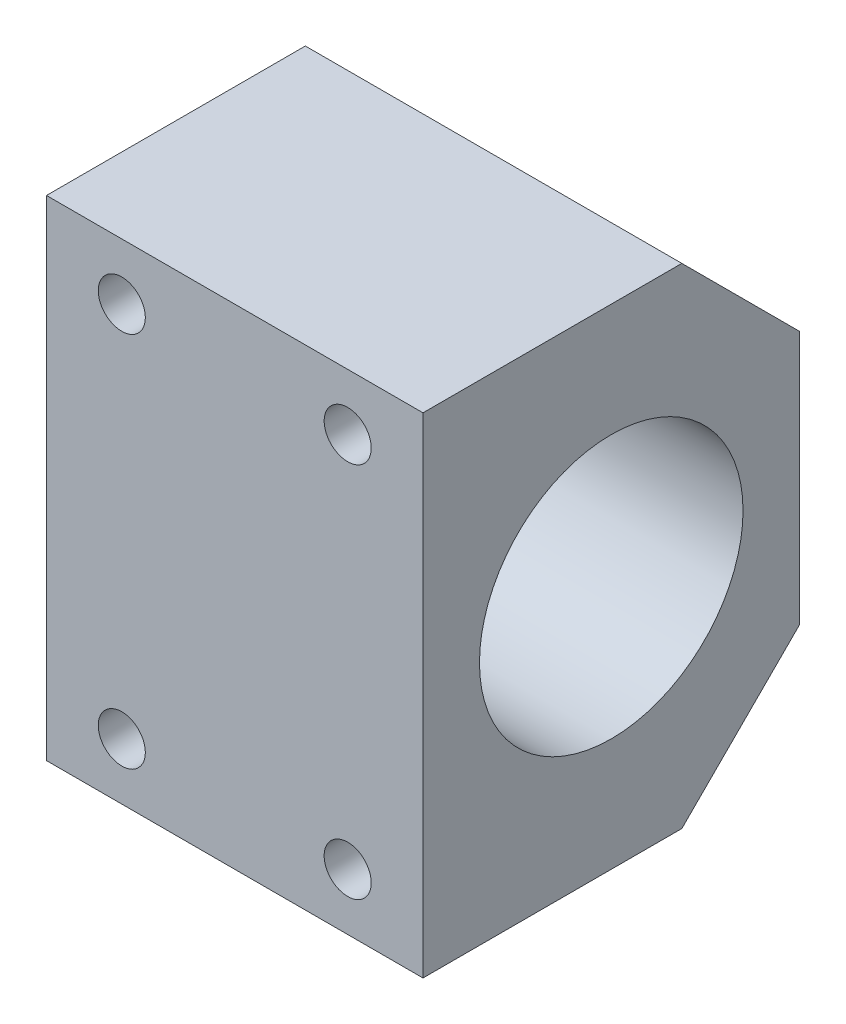
ISO-10303-21;
HEADER;
FILE_DESCRIPTION(('STEP AP214'),'2;1');
FILE_NAME('part.step','',(''),(''),'','','');
FILE_SCHEMA(('AUTOMOTIVE_DESIGN { 1 0 10303 214 1 1 1 1 }'));
ENDSEC;
DATA;
#1=APPLICATION_CONTEXT('core data for automotive mechanical design processes');
#2=APPLICATION_PROTOCOL_DEFINITION('international standard','automotive_design',2000,#1);
#3=PRODUCT_CONTEXT('',#1,'mechanical');
#4=PRODUCT('Part','Part','',(#3));
#5=PRODUCT_RELATED_PRODUCT_CATEGORY('part','',(#4));
#6=PRODUCT_DEFINITION_FORMATION('','',#4);
#7=PRODUCT_DEFINITION_CONTEXT('part definition',#1,'design');
#8=PRODUCT_DEFINITION('design','',#6,#7);
#9=PRODUCT_DEFINITION_SHAPE('','',#8);
#10=(LENGTH_UNIT() NAMED_UNIT(*) SI_UNIT(.MILLI.,.METRE.));
#11=(NAMED_UNIT(*) PLANE_ANGLE_UNIT() SI_UNIT($,.RADIAN.));
#12=(NAMED_UNIT(*) SI_UNIT($,.STERADIAN.) SOLID_ANGLE_UNIT());
#13=UNCERTAINTY_MEASURE_WITH_UNIT(LENGTH_MEASURE(1.E-05),#10,'distance_accuracy_value','');
#14=(GEOMETRIC_REPRESENTATION_CONTEXT(3) GLOBAL_UNCERTAINTY_ASSIGNED_CONTEXT((#13)) GLOBAL_UNIT_ASSIGNED_CONTEXT((#10,
#11,#12)) REPRESENTATION_CONTEXT('',''));
#15=CARTESIAN_POINT('',(0.,0.,0.));
#16=DIRECTION('',(0.,0.,1.));
#17=DIRECTION('',(1.,0.,0.));
#18=AXIS2_PLACEMENT_3D('',#15,#16,#17);
#19=CARTESIAN_POINT('',(0.,0.,0.));
#20=DIRECTION('',(1.,0.,0.));
#21=DIRECTION('',(0.,1.,0.));
#22=AXIS2_PLACEMENT_3D('',#19,#20,#21);
#23=PLANE('',#22);
#24=CARTESIAN_POINT('',(0.,-13.4350288425444,13.4350288425444));
#25=DIRECTION('',(-1.,0.,0.));
#26=DIRECTION('',(0.,1.,0.));
#27=AXIS2_PLACEMENT_3D('',#24,#25,#26);
#28=CIRCLE('',#27,2.5);
#29=CARTESIAN_POINT('',(0.,-15.9350288425444,13.4350288425444));
#30=VERTEX_POINT('',#29);
#31=EDGE_CURVE('E271',#30,#30,#28,.T.);
#32=ORIENTED_EDGE('',*,*,#31,.F.);
#33=EDGE_LOOP('',(#32));
#34=FACE_BOUND('',#33,.T.);
#35=CARTESIAN_POINT('',(0.,-19.,0.));
#36=DIRECTION('',(-1.,0.,0.));
#37=DIRECTION('',(0.,1.,0.));
#38=AXIS2_PLACEMENT_3D('',#35,#36,#37);
#39=CIRCLE('',#38,2.5);
#40=CARTESIAN_POINT('',(0.,-21.5,0.));
#41=VERTEX_POINT('',#40);
#42=EDGE_CURVE('E324',#41,#41,#39,.T.);
#43=ORIENTED_EDGE('',*,*,#42,.F.);
#44=EDGE_LOOP('',(#43));
#45=FACE_BOUND('',#44,.T.);
#46=CARTESIAN_POINT('',(0.,-13.4350288425444,-13.4350288425444));
#47=DIRECTION('',(-1.,0.,0.));
#48=DIRECTION('',(0.,1.,0.));
#49=AXIS2_PLACEMENT_3D('',#46,#47,#48);
#50=CIRCLE('',#49,2.5);
#51=CARTESIAN_POINT('',(0.,-15.9350288425444,-13.4350288425444));
#52=VERTEX_POINT('',#51);
#53=EDGE_CURVE('E233',#52,#52,#50,.T.);
#54=ORIENTED_EDGE('',*,*,#53,.F.);
#55=EDGE_LOOP('',(#54));
#56=FACE_BOUND('',#55,.T.);
#57=CARTESIAN_POINT('',(0.,13.4350288425444,13.4350288425444));
#58=DIRECTION('',(-1.,0.,0.));
#59=DIRECTION('',(0.,1.,0.));
#60=AXIS2_PLACEMENT_3D('',#57,#58,#59);
#61=CIRCLE('',#60,2.5);
#62=CARTESIAN_POINT('',(0.,10.9350288425444,13.4350288425444));
#63=VERTEX_POINT('',#62);
#64=EDGE_CURVE('E217',#63,#63,#61,.T.);
#65=ORIENTED_EDGE('',*,*,#64,.F.);
#66=EDGE_LOOP('',(#65));
#67=FACE_BOUND('',#66,.T.);
#68=CARTESIAN_POINT('',(0.,13.4350288425444,-13.4350288425444));
#69=DIRECTION('',(-1.,0.,0.));
#70=DIRECTION('',(0.,1.,0.));
#71=AXIS2_PLACEMENT_3D('',#68,#69,#70);
#72=CIRCLE('',#71,2.5);
#73=CARTESIAN_POINT('',(0.,10.9350288425444,-13.4350288425444));
#74=VERTEX_POINT('',#73);
#75=EDGE_CURVE('E138',#74,#74,#72,.T.);
#76=ORIENTED_EDGE('',*,*,#75,.F.);
#77=EDGE_LOOP('',(#76));
#78=FACE_BOUND('',#77,.T.);
#79=CARTESIAN_POINT('',(0.,19.,0.));
#80=DIRECTION('',(-1.,0.,0.));
#81=DIRECTION('',(0.,1.,0.));
#82=AXIS2_PLACEMENT_3D('',#79,#80,#81);
#83=CIRCLE('',#82,2.5);
#84=CARTESIAN_POINT('',(0.,16.5,0.));
#85=VERTEX_POINT('',#84);
#86=EDGE_CURVE('E126',#85,#85,#83,.T.);
#87=ORIENTED_EDGE('',*,*,#86,.F.);
#88=EDGE_LOOP('',(#87));
#89=FACE_BOUND('',#88,.T.);
#90=CARTESIAN_POINT('',(0.,0.,0.));
#91=DIRECTION('',(-1.,0.,0.));
#92=DIRECTION('',(0.,1.,0.));
#93=AXIS2_PLACEMENT_3D('',#90,#91,#92);
#94=CIRCLE('',#93,14.);
#95=CARTESIAN_POINT('',(0.,-14.,0.));
#96=VERTEX_POINT('',#95);
#97=EDGE_CURVE('E183',#96,#96,#94,.T.);
#98=ORIENTED_EDGE('',*,*,#97,.F.);
#99=EDGE_LOOP('',(#98));
#100=FACE_BOUND('',#99,.T.);
#101=DIRECTION('',(0.,0.707106781186548,-0.707106781186548));
#102=VECTOR('',#101,1.);
#103=CARTESIAN_POINT('',(0.,-18.25,-15.25));
#104=LINE('',#103,#102);
#105=CARTESIAN_POINT('',(0.,-26.,-7.5));
#106=VERTEX_POINT('',#105);
#107=CARTESIAN_POINT('',(0.,-13.5,-20.));
#108=VERTEX_POINT('',#107);
#109=EDGE_CURVE('E263',#106,#108,#104,.T.);
#110=ORIENTED_EDGE('',*,*,#109,.F.);
#111=DIRECTION('',(0.,0.,-1.));
#112=VECTOR('',#111,1.);
#113=CARTESIAN_POINT('',(0.,-26.,20.));
#114=LINE('',#113,#112);
#115=CARTESIAN_POINT('',(0.,-26.,20.));
#116=VERTEX_POINT('',#115);
#117=EDGE_CURVE('E27',#116,#106,#114,.T.);
#118=ORIENTED_EDGE('',*,*,#117,.F.);
#119=DIRECTION('',(0.,-1.,0.));
#120=VECTOR('',#119,1.);
#121=CARTESIAN_POINT('',(0.,0.,20.));
#122=LINE('',#121,#120);
#123=CARTESIAN_POINT('',(0.,26.,20.));
#124=VERTEX_POINT('',#123);
#125=EDGE_CURVE('E11',#124,#116,#122,.T.);
#126=ORIENTED_EDGE('',*,*,#125,.F.);
#127=DIRECTION('',(0.,0.,-1.));
#128=VECTOR('',#127,1.);
#129=CARTESIAN_POINT('',(0.,26.,20.));
#130=LINE('',#129,#128);
#131=CARTESIAN_POINT('',(0.,26.,-7.5));
#132=VERTEX_POINT('',#131);
#133=EDGE_CURVE('E176',#124,#132,#130,.T.);
#134=ORIENTED_EDGE('',*,*,#133,.T.);
#135=DIRECTION('',(0.,0.707106781186548,0.707106781186548));
#136=VECTOR('',#135,1.);
#137=CARTESIAN_POINT('',(0.,18.25,-15.25));
#138=LINE('',#137,#136);
#139=CARTESIAN_POINT('',(0.,13.5,-20.));
#140=VERTEX_POINT('',#139);
#141=EDGE_CURVE('E180',#140,#132,#138,.T.);
#142=ORIENTED_EDGE('',*,*,#141,.F.);
#143=DIRECTION('',(0.,1.,0.));
#144=VECTOR('',#143,1.);
#145=CARTESIAN_POINT('',(0.,-26.,-20.));
#146=LINE('',#145,#144);
#147=EDGE_CURVE('E205',#108,#140,#146,.T.);
#148=ORIENTED_EDGE('',*,*,#147,.F.);
#149=EDGE_LOOP('',(#110,#118,#126,#134,#142,#148));
#150=FACE_BOUND('',#149,.T.);
#151=ADVANCED_FACE('F16',(#34,#45,#56,#67,#78,#89,#100,#150),#23,.F.);
#152=CARTESIAN_POINT('',(0.,26.,20.));
#153=DIRECTION('',(0.,0.,1.));
#154=DIRECTION('',(1.,0.,0.));
#155=AXIS2_PLACEMENT_3D('',#152,#153,#154);
#156=PLANE('',#155);
#157=CARTESIAN_POINT('',(8.,20.,20.));
#158=DIRECTION('',(0.,0.,-1.));
#159=DIRECTION('',(-1.,0.,0.));
#160=AXIS2_PLACEMENT_3D('',#157,#158,#159);
#161=CIRCLE('',#160,2.5);
#162=CARTESIAN_POINT('',(10.5,20.,20.));
#163=VERTEX_POINT('',#162);
#164=EDGE_CURVE('E222',#163,#163,#161,.T.);
#165=ORIENTED_EDGE('',*,*,#164,.T.);
#166=EDGE_LOOP('',(#165));
#167=FACE_BOUND('',#166,.T.);
#168=CARTESIAN_POINT('',(32.,-20.,20.));
#169=DIRECTION('',(0.,0.,-1.));
#170=DIRECTION('',(-1.,0.,0.));
#171=AXIS2_PLACEMENT_3D('',#168,#169,#170);
#172=CIRCLE('',#171,2.5);
#173=CARTESIAN_POINT('',(34.5,-20.,20.));
#174=VERTEX_POINT('',#173);
#175=EDGE_CURVE('E301',#174,#174,#172,.T.);
#176=ORIENTED_EDGE('',*,*,#175,.T.);
#177=EDGE_LOOP('',(#176));
#178=FACE_BOUND('',#177,.T.);
#179=CARTESIAN_POINT('',(32.,20.,20.));
#180=DIRECTION('',(0.,0.,-1.));
#181=DIRECTION('',(-1.,0.,0.));
#182=AXIS2_PLACEMENT_3D('',#179,#180,#181);
#183=CIRCLE('',#182,2.5);
#184=CARTESIAN_POINT('',(34.5,20.,20.));
#185=VERTEX_POINT('',#184);
#186=EDGE_CURVE('E258',#185,#185,#183,.T.);
#187=ORIENTED_EDGE('',*,*,#186,.T.);
#188=EDGE_LOOP('',(#187));
#189=FACE_BOUND('',#188,.T.);
#190=CARTESIAN_POINT('',(8.,-20.,20.));
#191=DIRECTION('',(0.,0.,-1.));
#192=DIRECTION('',(-1.,0.,0.));
#193=AXIS2_PLACEMENT_3D('',#190,#191,#192);
#194=CIRCLE('',#193,2.5);
#195=CARTESIAN_POINT('',(10.5,-20.,20.));
#196=VERTEX_POINT('',#195);
#197=EDGE_CURVE('E340',#196,#196,#194,.T.);
#198=ORIENTED_EDGE('',*,*,#197,.T.);
#199=EDGE_LOOP('',(#198));
#200=FACE_BOUND('',#199,.T.);
#201=ORIENTED_EDGE('',*,*,#125,.T.);
#202=DIRECTION('',(1.,0.,0.));
#203=VECTOR('',#202,1.);
#204=CARTESIAN_POINT('',(0.,-26.,20.));
#205=LINE('',#204,#203);
#206=CARTESIAN_POINT('',(40.,-26.,20.));
#207=VERTEX_POINT('',#206);
#208=EDGE_CURVE('E166',#116,#207,#205,.T.);
#209=ORIENTED_EDGE('',*,*,#208,.T.);
#210=DIRECTION('',(0.,-1.,0.));
#211=VECTOR('',#210,1.);
#212=CARTESIAN_POINT('',(40.,26.,20.));
#213=LINE('',#212,#211);
#214=CARTESIAN_POINT('',(40.,26.,20.));
#215=VERTEX_POINT('',#214);
#216=EDGE_CURVE('E230',#215,#207,#213,.T.);
#217=ORIENTED_EDGE('',*,*,#216,.F.);
#218=DIRECTION('',(1.,0.,0.));
#219=VECTOR('',#218,1.);
#220=CARTESIAN_POINT('',(0.,26.,20.));
#221=LINE('',#220,#219);
#222=EDGE_CURVE('E158',#124,#215,#221,.T.);
#223=ORIENTED_EDGE('',*,*,#222,.F.);
#224=EDGE_LOOP('',(#201,#209,#217,#223));
#225=FACE_BOUND('',#224,.T.);
#226=ADVANCED_FACE('F410',(#167,#178,#189,#200,#225),#156,.T.);
#227=CARTESIAN_POINT('',(0.,-26.,20.));
#228=DIRECTION('',(0.,-1.,0.));
#229=DIRECTION('',(0.,0.,-1.));
#230=AXIS2_PLACEMENT_3D('',#227,#228,#229);
#231=PLANE('',#230);
#232=DIRECTION('',(-1.,0.,0.));
#233=VECTOR('',#232,1.);
#234=CARTESIAN_POINT('',(0.,-26.,-7.5));
#235=LINE('',#234,#233);
#236=CARTESIAN_POINT('',(40.,-26.,-7.5));
#237=VERTEX_POINT('',#236);
#238=EDGE_CURVE('E267',#237,#106,#235,.T.);
#239=ORIENTED_EDGE('',*,*,#238,.F.);
#240=DIRECTION('',(0.,0.,-1.));
#241=VECTOR('',#240,1.);
#242=CARTESIAN_POINT('',(40.,-26.,20.));
#243=LINE('',#242,#241);
#244=EDGE_CURVE('E209',#207,#237,#243,.T.);
#245=ORIENTED_EDGE('',*,*,#244,.F.);
#246=ORIENTED_EDGE('',*,*,#208,.F.);
#247=ORIENTED_EDGE('',*,*,#117,.T.);
#248=EDGE_LOOP('',(#239,#245,#246,#247));
#249=FACE_BOUND('',#248,.T.);
#250=ADVANCED_FACE('F375',(#249),#231,.T.);
#251=CARTESIAN_POINT('',(0.,26.,-20.));
#252=DIRECTION('',(0.,1.,0.));
#253=DIRECTION('',(1.,0.,0.));
#254=AXIS2_PLACEMENT_3D('',#251,#252,#253);
#255=PLANE('',#254);
#256=DIRECTION('',(1.,0.,0.));
#257=VECTOR('',#256,1.);
#258=CARTESIAN_POINT('',(0.,26.,-7.5));
#259=LINE('',#258,#257);
#260=CARTESIAN_POINT('',(40.,26.,-7.5));
#261=VERTEX_POINT('',#260);
#262=EDGE_CURVE('E185',#132,#261,#259,.T.);
#263=ORIENTED_EDGE('',*,*,#262,.F.);
#264=ORIENTED_EDGE('',*,*,#133,.F.);
#265=ORIENTED_EDGE('',*,*,#222,.T.);
#266=DIRECTION('',(0.,0.,1.));
#267=VECTOR('',#266,1.);
#268=CARTESIAN_POINT('',(40.,26.,-20.));
#269=LINE('',#268,#267);
#270=EDGE_CURVE('E188',#261,#215,#269,.T.);
#271=ORIENTED_EDGE('',*,*,#270,.F.);
#272=EDGE_LOOP('',(#263,#264,#265,#271));
#273=FACE_BOUND('',#272,.T.);
#274=ADVANCED_FACE('F186',(#273),#255,.T.);
#275=CARTESIAN_POINT('',(0.,0.,0.));
#276=DIRECTION('',(1.,0.,0.));
#277=DIRECTION('',(0.,1.,0.));
#278=AXIS2_PLACEMENT_3D('',#275,#276,#277);
#279=CYLINDRICAL_SURFACE('',#278,14.);
#280=CARTESIAN_POINT('',(40.,0.,0.));
#281=DIRECTION('',(-1.,0.,0.));
#282=DIRECTION('',(0.,1.,0.));
#283=AXIS2_PLACEMENT_3D('',#280,#281,#282);
#284=CIRCLE('',#283,14.);
#285=CARTESIAN_POINT('',(40.,-14.,0.));
#286=VERTEX_POINT('',#285);
#287=EDGE_CURVE('E279',#286,#286,#284,.T.);
#288=ORIENTED_EDGE('',*,*,#287,.F.);
#289=DIRECTION('',(-1.,0.,0.));
#290=VECTOR('',#289,1.);
#291=CARTESIAN_POINT('',(0.,-14.,0.));
#292=LINE('',#291,#290);
#293=EDGE_CURVE('E259',#286,#96,#292,.T.);
#294=ORIENTED_EDGE('',*,*,#293,.T.);
#295=ORIENTED_EDGE('',*,*,#97,.T.);
#296=ORIENTED_EDGE('',*,*,#293,.F.);
#297=EDGE_LOOP('',(#288,#294,#295,#296));
#298=FACE_BOUND('',#297,.T.);
#299=ADVANCED_FACE('F759',(#298),#279,.F.);
#300=CARTESIAN_POINT('',(0.,19.,0.));
#301=DIRECTION('',(1.,0.,0.));
#302=DIRECTION('',(0.,1.,0.));
#303=AXIS2_PLACEMENT_3D('',#300,#301,#302);
#304=CYLINDRICAL_SURFACE('',#303,2.5);
#305=CARTESIAN_POINT('',(15.6,19.,0.));
#306=DIRECTION('',(-1.,0.,0.));
#307=DIRECTION('',(0.,1.,0.));
#308=AXIS2_PLACEMENT_3D('',#305,#306,#307);
#309=CIRCLE('',#308,2.5);
#310=CARTESIAN_POINT('',(15.6,16.5,0.));
#311=VERTEX_POINT('',#310);
#312=EDGE_CURVE('E193',#311,#311,#309,.T.);
#313=ORIENTED_EDGE('',*,*,#312,.F.);
#314=DIRECTION('',(-1.,0.,0.));
#315=VECTOR('',#314,1.);
#316=CARTESIAN_POINT('',(0.,16.5,0.));
#317=LINE('',#316,#315);
#318=EDGE_CURVE('E211',#311,#85,#317,.T.);
#319=ORIENTED_EDGE('',*,*,#318,.T.);
#320=ORIENTED_EDGE('',*,*,#86,.T.);
#321=ORIENTED_EDGE('',*,*,#318,.F.);
#322=EDGE_LOOP('',(#313,#319,#320,#321));
#323=FACE_BOUND('',#322,.T.);
#324=ADVANCED_FACE('F753',(#323),#304,.F.);
#325=CARTESIAN_POINT('',(0.,13.4350288425444,-13.4350288425444));
#326=DIRECTION('',(1.,0.,0.));
#327=DIRECTION('',(0.,1.,0.));
#328=AXIS2_PLACEMENT_3D('',#325,#326,#327);
#329=CYLINDRICAL_SURFACE('',#328,2.5);
#330=CARTESIAN_POINT('',(15.6,13.4350288425444,-13.4350288425444));
#331=DIRECTION('',(-1.,0.,0.));
#332=DIRECTION('',(0.,1.,0.));
#333=AXIS2_PLACEMENT_3D('',#330,#331,#332);
#334=CIRCLE('',#333,2.5);
#335=CARTESIAN_POINT('',(15.6,10.9350288425444,-13.4350288425444));
#336=VERTEX_POINT('',#335);
#337=EDGE_CURVE('E246',#336,#336,#334,.T.);
#338=ORIENTED_EDGE('',*,*,#337,.F.);
#339=DIRECTION('',(-1.,0.,0.));
#340=VECTOR('',#339,1.);
#341=CARTESIAN_POINT('',(0.,10.9350288425444,-13.4350288425444));
#342=LINE('',#341,#340);
#343=EDGE_CURVE('E214',#336,#74,#342,.T.);
#344=ORIENTED_EDGE('',*,*,#343,.T.);
#345=ORIENTED_EDGE('',*,*,#75,.T.);
#346=ORIENTED_EDGE('',*,*,#343,.F.);
#347=EDGE_LOOP('',(#338,#344,#345,#346));
#348=FACE_BOUND('',#347,.T.);
#349=ADVANCED_FACE('F758',(#348),#329,.F.);
#350=CARTESIAN_POINT('',(0.,13.4350288425444,13.4350288425444));
#351=DIRECTION('',(1.,0.,0.));
#352=DIRECTION('',(0.,1.,0.));
#353=AXIS2_PLACEMENT_3D('',#350,#351,#352);
#354=CYLINDRICAL_SURFACE('',#353,2.5);
#355=CARTESIAN_POINT('',(15.6,13.4350288425444,13.4350288425444));
#356=DIRECTION('',(-1.,0.,0.));
#357=DIRECTION('',(0.,1.,0.));
#358=AXIS2_PLACEMENT_3D('',#355,#356,#357);
#359=CIRCLE('',#358,2.5);
#360=CARTESIAN_POINT('',(15.6,10.9350288425444,13.4350288425444));
#361=VERTEX_POINT('',#360);
#362=EDGE_CURVE('E250',#361,#361,#359,.T.);
#363=ORIENTED_EDGE('',*,*,#362,.F.);
#364=DIRECTION('',(-1.,0.,0.));
#365=VECTOR('',#364,1.);
#366=CARTESIAN_POINT('',(0.,10.9350288425444,13.4350288425444));
#367=LINE('',#366,#365);
#368=EDGE_CURVE('E235',#361,#63,#367,.T.);
#369=ORIENTED_EDGE('',*,*,#368,.T.);
#370=ORIENTED_EDGE('',*,*,#64,.T.);
#371=ORIENTED_EDGE('',*,*,#368,.F.);
#372=EDGE_LOOP('',(#363,#369,#370,#371));
#373=FACE_BOUND('',#372,.T.);
#374=ADVANCED_FACE('F767',(#373),#354,.F.);
#375=CARTESIAN_POINT('',(0.,-13.4350288425444,-13.4350288425444));
#376=DIRECTION('',(1.,0.,0.));
#377=DIRECTION('',(0.,1.,0.));
#378=AXIS2_PLACEMENT_3D('',#375,#376,#377);
#379=CYLINDRICAL_SURFACE('',#378,2.5);
#380=CARTESIAN_POINT('',(15.6,-13.4350288425444,-13.4350288425444));
#381=DIRECTION('',(-1.,0.,0.));
#382=DIRECTION('',(0.,1.,0.));
#383=AXIS2_PLACEMENT_3D('',#380,#381,#382);
#384=CIRCLE('',#383,2.5);
#385=CARTESIAN_POINT('',(15.6,-15.9350288425444,-13.4350288425444));
#386=VERTEX_POINT('',#385);
#387=EDGE_CURVE('E297',#386,#386,#384,.T.);
#388=ORIENTED_EDGE('',*,*,#387,.F.);
#389=DIRECTION('',(-1.,0.,0.));
#390=VECTOR('',#389,1.);
#391=CARTESIAN_POINT('',(0.,-15.9350288425444,-13.4350288425444));
#392=LINE('',#391,#390);
#393=EDGE_CURVE('E236',#386,#52,#392,.T.);
#394=ORIENTED_EDGE('',*,*,#393,.T.);
#395=ORIENTED_EDGE('',*,*,#53,.T.);
#396=ORIENTED_EDGE('',*,*,#393,.F.);
#397=EDGE_LOOP('',(#388,#394,#395,#396));
#398=FACE_BOUND('',#397,.T.);
#399=ADVANCED_FACE('F389',(#398),#379,.F.);
#400=CARTESIAN_POINT('',(0.,-19.,0.));
#401=DIRECTION('',(1.,0.,0.));
#402=DIRECTION('',(0.,1.,0.));
#403=AXIS2_PLACEMENT_3D('',#400,#401,#402);
#404=CYLINDRICAL_SURFACE('',#403,2.5);
#405=CARTESIAN_POINT('',(15.6,-19.,0.));
#406=DIRECTION('',(-1.,0.,0.));
#407=DIRECTION('',(0.,1.,0.));
#408=AXIS2_PLACEMENT_3D('',#405,#406,#407);
#409=CIRCLE('',#408,2.5);
#410=CARTESIAN_POINT('',(15.6,-21.5,0.));
#411=VERTEX_POINT('',#410);
#412=EDGE_CURVE('E293',#411,#411,#409,.T.);
#413=ORIENTED_EDGE('',*,*,#412,.F.);
#414=DIRECTION('',(-1.,0.,0.));
#415=VECTOR('',#414,1.);
#416=CARTESIAN_POINT('',(0.,-21.5,0.));
#417=LINE('',#416,#415);
#418=EDGE_CURVE('E327',#411,#41,#417,.T.);
#419=ORIENTED_EDGE('',*,*,#418,.T.);
#420=ORIENTED_EDGE('',*,*,#42,.T.);
#421=ORIENTED_EDGE('',*,*,#418,.F.);
#422=EDGE_LOOP('',(#413,#419,#420,#421));
#423=FACE_BOUND('',#422,.T.);
#424=ADVANCED_FACE('F445',(#423),#404,.F.);
#425=CARTESIAN_POINT('',(0.,-13.4350288425444,13.4350288425444));
#426=DIRECTION('',(1.,0.,0.));
#427=DIRECTION('',(0.,1.,0.));
#428=AXIS2_PLACEMENT_3D('',#425,#426,#427);
#429=CYLINDRICAL_SURFACE('',#428,2.5);
#430=CARTESIAN_POINT('',(15.6,-13.4350288425444,13.4350288425444));
#431=DIRECTION('',(-1.,0.,0.));
#432=DIRECTION('',(0.,1.,0.));
#433=AXIS2_PLACEMENT_3D('',#430,#431,#432);
#434=CIRCLE('',#433,2.5);
#435=CARTESIAN_POINT('',(15.6,-15.9350288425444,13.4350288425444));
#436=VERTEX_POINT('',#435);
#437=EDGE_CURVE('E272',#436,#436,#434,.T.);
#438=ORIENTED_EDGE('',*,*,#437,.F.);
#439=DIRECTION('',(-1.,0.,0.));
#440=VECTOR('',#439,1.);
#441=CARTESIAN_POINT('',(0.,-15.9350288425444,13.4350288425444));
#442=LINE('',#441,#440);
#443=EDGE_CURVE('E268',#436,#30,#442,.T.);
#444=ORIENTED_EDGE('',*,*,#443,.T.);
#445=ORIENTED_EDGE('',*,*,#31,.T.);
#446=ORIENTED_EDGE('',*,*,#443,.F.);
#447=EDGE_LOOP('',(#438,#444,#445,#446));
#448=FACE_BOUND('',#447,.T.);
#449=ADVANCED_FACE('F781',(#448),#429,.F.);
#450=CARTESIAN_POINT('',(15.6,0.,0.));
#451=DIRECTION('',(1.,0.,0.));
#452=DIRECTION('',(0.,1.,0.));
#453=AXIS2_PLACEMENT_3D('',#450,#451,#452);
#454=PLANE('',#453);
#455=ORIENTED_EDGE('',*,*,#437,.T.);
#456=EDGE_LOOP('',(#455));
#457=FACE_BOUND('',#456,.T.);
#458=ADVANCED_FACE('F18',(#457),#454,.F.);
#459=CARTESIAN_POINT('',(15.6,0.,0.));
#460=DIRECTION('',(1.,0.,0.));
#461=DIRECTION('',(0.,1.,0.));
#462=AXIS2_PLACEMENT_3D('',#459,#460,#461);
#463=PLANE('',#462);
#464=ORIENTED_EDGE('',*,*,#412,.T.);
#465=EDGE_LOOP('',(#464));
#466=FACE_BOUND('',#465,.T.);
#467=ADVANCED_FACE('F395',(#466),#463,.F.);
#468=CARTESIAN_POINT('',(15.6,0.,0.));
#469=DIRECTION('',(1.,0.,0.));
#470=DIRECTION('',(0.,1.,0.));
#471=AXIS2_PLACEMENT_3D('',#468,#469,#470);
#472=PLANE('',#471);
#473=ORIENTED_EDGE('',*,*,#387,.T.);
#474=EDGE_LOOP('',(#473));
#475=FACE_BOUND('',#474,.T.);
#476=ADVANCED_FACE('F392',(#475),#472,.F.);
#477=CARTESIAN_POINT('',(15.6,0.,0.));
#478=DIRECTION('',(1.,0.,0.));
#479=DIRECTION('',(0.,1.,0.));
#480=AXIS2_PLACEMENT_3D('',#477,#478,#479);
#481=PLANE('',#480);
#482=ORIENTED_EDGE('',*,*,#362,.T.);
#483=EDGE_LOOP('',(#482));
#484=FACE_BOUND('',#483,.T.);
#485=ADVANCED_FACE('F394',(#484),#481,.F.);
#486=CARTESIAN_POINT('',(15.6,0.,0.));
#487=DIRECTION('',(1.,0.,0.));
#488=DIRECTION('',(0.,1.,0.));
#489=AXIS2_PLACEMENT_3D('',#486,#487,#488);
#490=PLANE('',#489);
#491=ORIENTED_EDGE('',*,*,#337,.T.);
#492=EDGE_LOOP('',(#491));
#493=FACE_BOUND('',#492,.T.);
#494=ADVANCED_FACE('F402',(#493),#490,.F.);
#495=CARTESIAN_POINT('',(15.6,0.,0.));
#496=DIRECTION('',(1.,0.,0.));
#497=DIRECTION('',(0.,1.,0.));
#498=AXIS2_PLACEMENT_3D('',#495,#496,#497);
#499=PLANE('',#498);
#500=ORIENTED_EDGE('',*,*,#312,.T.);
#501=EDGE_LOOP('',(#500));
#502=FACE_BOUND('',#501,.T.);
#503=ADVANCED_FACE('F430',(#502),#499,.F.);
#504=CARTESIAN_POINT('',(0.,19.75,-13.75));
#505=DIRECTION('',(0.,0.707106781186548,-0.707106781186548));
#506=DIRECTION('',(-1.,0.,0.));
#507=AXIS2_PLACEMENT_3D('',#504,#505,#506);
#508=PLANE('',#507);
#509=DIRECTION('',(0.,-0.707106781186548,-0.707106781186548));
#510=VECTOR('',#509,1.);
#511=CARTESIAN_POINT('',(40.,18.25,-15.25));
#512=LINE('',#511,#510);
#513=CARTESIAN_POINT('',(40.,13.5,-20.));
#514=VERTEX_POINT('',#513);
#515=EDGE_CURVE('E20',#261,#514,#512,.T.);
#516=ORIENTED_EDGE('',*,*,#515,.T.);
#517=DIRECTION('',(-1.,0.,0.));
#518=VECTOR('',#517,1.);
#519=CARTESIAN_POINT('',(0.,13.5,-20.));
#520=LINE('',#519,#518);
#521=EDGE_CURVE('E197',#514,#140,#520,.T.);
#522=ORIENTED_EDGE('',*,*,#521,.T.);
#523=ORIENTED_EDGE('',*,*,#141,.T.);
#524=ORIENTED_EDGE('',*,*,#262,.T.);
#525=EDGE_LOOP('',(#516,#522,#523,#524));
#526=FACE_BOUND('',#525,.T.);
#527=ADVANCED_FACE('F195',(#526),#508,.T.);
#528=CARTESIAN_POINT('',(0.,-26.,-20.));
#529=DIRECTION('',(0.,0.,-1.));
#530=DIRECTION('',(0.,-1.,0.));
#531=AXIS2_PLACEMENT_3D('',#528,#529,#530);
#532=PLANE('',#531);
#533=DIRECTION('',(1.,0.,0.));
#534=VECTOR('',#533,1.);
#535=CARTESIAN_POINT('',(0.,-13.5,-20.));
#536=LINE('',#535,#534);
#537=CARTESIAN_POINT('',(40.,-13.5,-20.));
#538=VERTEX_POINT('',#537);
#539=EDGE_CURVE('E241',#108,#538,#536,.T.);
#540=ORIENTED_EDGE('',*,*,#539,.F.);
#541=ORIENTED_EDGE('',*,*,#147,.T.);
#542=ORIENTED_EDGE('',*,*,#521,.F.);
#543=DIRECTION('',(0.,1.,0.));
#544=VECTOR('',#543,1.);
#545=CARTESIAN_POINT('',(40.,-26.,-20.));
#546=LINE('',#545,#544);
#547=EDGE_CURVE('E238',#538,#514,#546,.T.);
#548=ORIENTED_EDGE('',*,*,#547,.F.);
#549=EDGE_LOOP('',(#540,#541,#542,#548));
#550=FACE_BOUND('',#549,.T.);
#551=ADVANCED_FACE('F378',(#550),#532,.T.);
#552=CARTESIAN_POINT('',(40.,0.,0.));
#553=DIRECTION('',(1.,0.,0.));
#554=DIRECTION('',(0.,1.,0.));
#555=AXIS2_PLACEMENT_3D('',#552,#553,#554);
#556=PLANE('',#555);
#557=ORIENTED_EDGE('',*,*,#287,.T.);
#558=EDGE_LOOP('',(#557));
#559=FACE_BOUND('',#558,.T.);
#560=DIRECTION('',(0.,-0.707106781186548,0.707106781186548));
#561=VECTOR('',#560,1.);
#562=CARTESIAN_POINT('',(40.,-18.25,-15.25));
#563=LINE('',#562,#561);
#564=EDGE_CURVE('E334',#538,#237,#563,.T.);
#565=ORIENTED_EDGE('',*,*,#564,.F.);
#566=ORIENTED_EDGE('',*,*,#547,.T.);
#567=ORIENTED_EDGE('',*,*,#515,.F.);
#568=ORIENTED_EDGE('',*,*,#270,.T.);
#569=ORIENTED_EDGE('',*,*,#216,.T.);
#570=ORIENTED_EDGE('',*,*,#244,.T.);
#571=EDGE_LOOP('',(#565,#566,#567,#568,#569,#570));
#572=FACE_BOUND('',#571,.T.);
#573=ADVANCED_FACE('F379',(#559,#572),#556,.T.);
#574=CARTESIAN_POINT('',(0.,-19.75,-13.75));
#575=DIRECTION('',(0.,-0.707106781186548,-0.707106781186548));
#576=DIRECTION('',(0.,-0.707106781186548,0.707106781186548));
#577=AXIS2_PLACEMENT_3D('',#574,#575,#576);
#578=PLANE('',#577);
#579=ORIENTED_EDGE('',*,*,#564,.T.);
#580=ORIENTED_EDGE('',*,*,#238,.T.);
#581=ORIENTED_EDGE('',*,*,#109,.T.);
#582=ORIENTED_EDGE('',*,*,#539,.T.);
#583=EDGE_LOOP('',(#579,#580,#581,#582));
#584=FACE_BOUND('',#583,.T.);
#585=ADVANCED_FACE('F373',(#584),#578,.T.);
#586=CARTESIAN_POINT('',(8.,20.,4.4));
#587=DIRECTION('',(0.,0.,1.));
#588=DIRECTION('',(1.,0.,0.));
#589=AXIS2_PLACEMENT_3D('',#586,#587,#588);
#590=PLANE('',#589);
#591=CARTESIAN_POINT('',(8.,20.,4.4));
#592=DIRECTION('',(0.,0.,-1.));
#593=DIRECTION('',(-1.,0.,0.));
#594=AXIS2_PLACEMENT_3D('',#591,#592,#593);
#595=CIRCLE('',#594,2.5);
#596=CARTESIAN_POINT('',(10.5,20.,4.4));
#597=VERTEX_POINT('',#596);
#598=EDGE_CURVE('E313',#597,#597,#595,.T.);
#599=ORIENTED_EDGE('',*,*,#598,.F.);
#600=EDGE_LOOP('',(#599));
#601=FACE_BOUND('',#600,.T.);
#602=ADVANCED_FACE('F427',(#601),#590,.T.);
#603=CARTESIAN_POINT('',(8.,20.,20.));
#604=DIRECTION('',(0.,0.,-1.));
#605=DIRECTION('',(-1.,0.,0.));
#606=AXIS2_PLACEMENT_3D('',#603,#604,#605);
#607=CYLINDRICAL_SURFACE('',#606,2.5);
#608=ORIENTED_EDGE('',*,*,#164,.F.);
#609=DIRECTION('',(0.,0.,-1.));
#610=VECTOR('',#609,1.);
#611=CARTESIAN_POINT('',(10.5,20.,20.));
#612=LINE('',#611,#610);
#613=EDGE_CURVE('E226',#163,#597,#612,.T.);
#614=ORIENTED_EDGE('',*,*,#613,.T.);
#615=ORIENTED_EDGE('',*,*,#598,.T.);
#616=ORIENTED_EDGE('',*,*,#613,.F.);
#617=EDGE_LOOP('',(#608,#614,#615,#616));
#618=FACE_BOUND('',#617,.T.);
#619=ADVANCED_FACE('F423',(#618),#607,.F.);
#620=CARTESIAN_POINT('',(32.,-20.,4.4));
#621=DIRECTION('',(0.,0.,1.));
#622=DIRECTION('',(1.,0.,0.));
#623=AXIS2_PLACEMENT_3D('',#620,#621,#622);
#624=PLANE('',#623);
#625=CARTESIAN_POINT('',(32.,-20.,4.4));
#626=DIRECTION('',(0.,0.,-1.));
#627=DIRECTION('',(-1.,0.,0.));
#628=AXIS2_PLACEMENT_3D('',#625,#626,#627);
#629=CIRCLE('',#628,2.5);
#630=CARTESIAN_POINT('',(34.5,-20.,4.4));
#631=VERTEX_POINT('',#630);
#632=EDGE_CURVE('E227',#631,#631,#629,.T.);
#633=ORIENTED_EDGE('',*,*,#632,.F.);
#634=EDGE_LOOP('',(#633));
#635=FACE_BOUND('',#634,.T.);
#636=ADVANCED_FACE('F426',(#635),#624,.T.);
#637=CARTESIAN_POINT('',(32.,-20.,20.));
#638=DIRECTION('',(0.,0.,-1.));
#639=DIRECTION('',(-1.,0.,0.));
#640=AXIS2_PLACEMENT_3D('',#637,#638,#639);
#641=CYLINDRICAL_SURFACE('',#640,2.5);
#642=ORIENTED_EDGE('',*,*,#175,.F.);
#643=DIRECTION('',(0.,0.,-1.));
#644=VECTOR('',#643,1.);
#645=CARTESIAN_POINT('',(34.5,-20.,20.));
#646=LINE('',#645,#644);
#647=EDGE_CURVE('E305',#174,#631,#646,.T.);
#648=ORIENTED_EDGE('',*,*,#647,.T.);
#649=ORIENTED_EDGE('',*,*,#632,.T.);
#650=ORIENTED_EDGE('',*,*,#647,.F.);
#651=EDGE_LOOP('',(#642,#648,#649,#650));
#652=FACE_BOUND('',#651,.T.);
#653=ADVANCED_FACE('F467',(#652),#641,.F.);
#654=CARTESIAN_POINT('',(32.,20.,4.4));
#655=DIRECTION('',(0.,0.,1.));
#656=DIRECTION('',(1.,0.,0.));
#657=AXIS2_PLACEMENT_3D('',#654,#655,#656);
#658=PLANE('',#657);
#659=CARTESIAN_POINT('',(32.,20.,4.4));
#660=DIRECTION('',(0.,0.,-1.));
#661=DIRECTION('',(-1.,0.,0.));
#662=AXIS2_PLACEMENT_3D('',#659,#660,#661);
#663=CIRCLE('',#662,2.5);
#664=CARTESIAN_POINT('',(34.5,20.,4.4));
#665=VERTEX_POINT('',#664);
#666=EDGE_CURVE('E257',#665,#665,#663,.T.);
#667=ORIENTED_EDGE('',*,*,#666,.F.);
#668=EDGE_LOOP('',(#667));
#669=FACE_BOUND('',#668,.T.);
#670=ADVANCED_FACE('F458',(#669),#658,.T.);
#671=CARTESIAN_POINT('',(32.,20.,20.));
#672=DIRECTION('',(0.,0.,-1.));
#673=DIRECTION('',(-1.,0.,0.));
#674=AXIS2_PLACEMENT_3D('',#671,#672,#673);
#675=CYLINDRICAL_SURFACE('',#674,2.5);
#676=ORIENTED_EDGE('',*,*,#186,.F.);
#677=DIRECTION('',(0.,0.,-1.));
#678=VECTOR('',#677,1.);
#679=CARTESIAN_POINT('',(34.5,20.,20.));
#680=LINE('',#679,#678);
#681=EDGE_CURVE('E253',#185,#665,#680,.T.);
#682=ORIENTED_EDGE('',*,*,#681,.T.);
#683=ORIENTED_EDGE('',*,*,#666,.T.);
#684=ORIENTED_EDGE('',*,*,#681,.F.);
#685=EDGE_LOOP('',(#676,#682,#683,#684));
#686=FACE_BOUND('',#685,.T.);
#687=ADVANCED_FACE('F450',(#686),#675,.F.);
#688=CARTESIAN_POINT('',(8.,-20.,4.4));
#689=DIRECTION('',(0.,0.,1.));
#690=DIRECTION('',(1.,0.,0.));
#691=AXIS2_PLACEMENT_3D('',#688,#689,#690);
#692=PLANE('',#691);
#693=CARTESIAN_POINT('',(8.,-20.,4.4));
#694=DIRECTION('',(0.,0.,-1.));
#695=DIRECTION('',(-1.,0.,0.));
#696=AXIS2_PLACEMENT_3D('',#693,#694,#695);
#697=CIRCLE('',#696,2.5);
#698=CARTESIAN_POINT('',(10.5,-20.,4.4));
#699=VERTEX_POINT('',#698);
#700=EDGE_CURVE('E309',#699,#699,#697,.T.);
#701=ORIENTED_EDGE('',*,*,#700,.F.);
#702=EDGE_LOOP('',(#701));
#703=FACE_BOUND('',#702,.T.);
#704=ADVANCED_FACE('F447',(#703),#692,.T.);
#705=CARTESIAN_POINT('',(8.,-20.,20.));
#706=DIRECTION('',(0.,0.,-1.));
#707=DIRECTION('',(-1.,0.,0.));
#708=AXIS2_PLACEMENT_3D('',#705,#706,#707);
#709=CYLINDRICAL_SURFACE('',#708,2.5);
#710=ORIENTED_EDGE('',*,*,#197,.F.);
#711=DIRECTION('',(0.,0.,-1.));
#712=VECTOR('',#711,1.);
#713=CARTESIAN_POINT('',(10.5,-20.,20.));
#714=LINE('',#713,#712);
#715=EDGE_CURVE('E338',#196,#699,#714,.T.);
#716=ORIENTED_EDGE('',*,*,#715,.T.);
#717=ORIENTED_EDGE('',*,*,#700,.T.);
#718=ORIENTED_EDGE('',*,*,#715,.F.);
#719=EDGE_LOOP('',(#710,#716,#717,#718));
#720=FACE_BOUND('',#719,.T.);
#721=ADVANCED_FACE('F449',(#720),#709,.F.);
#722=CLOSED_SHELL('',(#151,#226,#250,#274,#299,#324,#349,#374,#399,#424,#449,#458,#467,#476,
#485,#494,#503,#527,#551,#573,#585,#602,#619,#636,#653,#670,#687,#704,#721));
#723=MANIFOLD_SOLID_BREP('B1',#722);
#724=ADVANCED_BREP_SHAPE_REPRESENTATION('',(#18,#723),#14);
#725=SHAPE_DEFINITION_REPRESENTATION(#9,#724);
ENDSEC;
END-ISO-10303-21;
